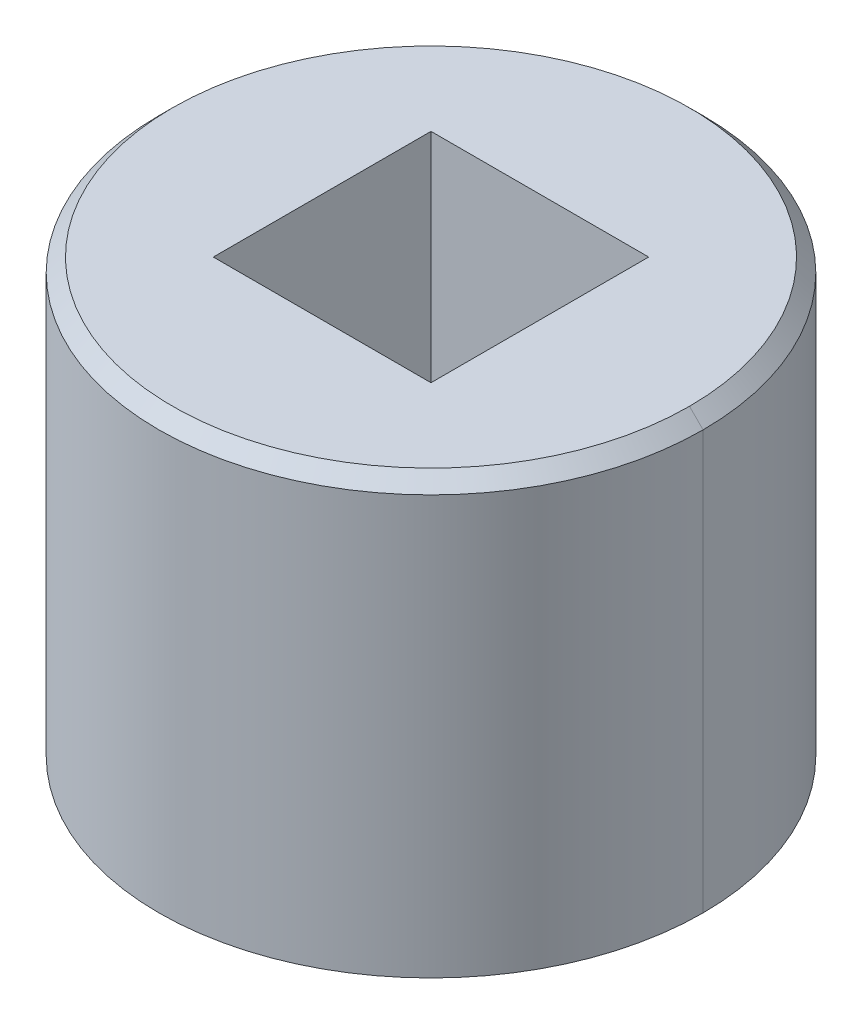
ISO-10303-21;
HEADER;
FILE_DESCRIPTION(('STEP AP214'),'2;1');
FILE_NAME('part.step','',(''),(''),'','','');
FILE_SCHEMA(('AUTOMOTIVE_DESIGN { 1 0 10303 214 1 1 1 1 }'));
ENDSEC;
DATA;
#1=APPLICATION_CONTEXT('core data for automotive mechanical design processes');
#2=APPLICATION_PROTOCOL_DEFINITION('international standard','automotive_design',2000,#1);
#3=PRODUCT_CONTEXT('',#1,'mechanical');
#4=PRODUCT('Part','Part','',(#3));
#5=PRODUCT_RELATED_PRODUCT_CATEGORY('part','',(#4));
#6=PRODUCT_DEFINITION_FORMATION('','',#4);
#7=PRODUCT_DEFINITION_CONTEXT('part definition',#1,'design');
#8=PRODUCT_DEFINITION('design','',#6,#7);
#9=PRODUCT_DEFINITION_SHAPE('','',#8);
#10=(LENGTH_UNIT() NAMED_UNIT(*) SI_UNIT(.MILLI.,.METRE.));
#11=(NAMED_UNIT(*) PLANE_ANGLE_UNIT() SI_UNIT($,.RADIAN.));
#12=(NAMED_UNIT(*) SI_UNIT($,.STERADIAN.) SOLID_ANGLE_UNIT());
#13=UNCERTAINTY_MEASURE_WITH_UNIT(LENGTH_MEASURE(1.E-05),#10,'distance_accuracy_value','');
#14=(GEOMETRIC_REPRESENTATION_CONTEXT(3) GLOBAL_UNCERTAINTY_ASSIGNED_CONTEXT((#13)) GLOBAL_UNIT_ASSIGNED_CONTEXT((#10,
#11,#12)) REPRESENTATION_CONTEXT('',''));
#15=CARTESIAN_POINT('',(0.,0.,0.));
#16=DIRECTION('',(0.,0.,1.));
#17=DIRECTION('',(1.,0.,0.));
#18=AXIS2_PLACEMENT_3D('',#15,#16,#17);
#19=CARTESIAN_POINT('',(0.,-3.175,0.));
#20=DIRECTION('',(0.,1.,0.));
#21=DIRECTION('',(1.,0.,0.));
#22=AXIS2_PLACEMENT_3D('',#19,#20,#21);
#23=PLANE('',#22);
#24=CARTESIAN_POINT('',(0.,-3.175,0.));
#25=DIRECTION('',(0.,-1.,0.));
#26=DIRECTION('',(0.,0.,-1.));
#27=AXIS2_PLACEMENT_3D('',#24,#25,#26);
#28=CIRCLE('',#27,4.);
#29=CARTESIAN_POINT('',(4.,-3.175,0.));
#30=VERTEX_POINT('',#29);
#31=CARTESIAN_POINT('',(-4.,-3.175,0.));
#32=VERTEX_POINT('',#31);
#33=EDGE_CURVE('E354',#30,#32,#28,.T.);
#34=ORIENTED_EDGE('',*,*,#33,.T.);
#35=CARTESIAN_POINT('',(0.,-3.175,0.));
#36=DIRECTION('',(0.,-1.,0.));
#37=DIRECTION('',(0.,0.,-1.));
#38=AXIS2_PLACEMENT_3D('',#35,#36,#37);
#39=CIRCLE('',#38,4.);
#40=EDGE_CURVE('E387',#32,#30,#39,.T.);
#41=ORIENTED_EDGE('',*,*,#40,.T.);
#42=EDGE_LOOP('',(#34,#41));
#43=FACE_BOUND('',#42,.T.);
#44=ADVANCED_FACE('F17',(#43),#23,.F.);
#45=CARTESIAN_POINT('',(1.6,0.,-1.6));
#46=DIRECTION('',(0.,0.,-1.));
#47=DIRECTION('',(0.,-1.,0.));
#48=AXIS2_PLACEMENT_3D('',#45,#46,#47);
#49=PLANE('',#48);
#50=DIRECTION('',(1.,0.,0.));
#51=VECTOR('',#50,1.);
#52=CARTESIAN_POINT('',(0.8,-2.825,-1.6));
#53=LINE('',#52,#51);
#54=CARTESIAN_POINT('',(-1.6,-2.825,-1.6));
#55=VERTEX_POINT('',#54);
#56=CARTESIAN_POINT('',(1.6,-2.825,-1.6));
#57=VERTEX_POINT('',#56);
#58=EDGE_CURVE('E59',#55,#57,#53,.T.);
#59=ORIENTED_EDGE('',*,*,#58,.T.);
#60=DIRECTION('',(0.,-1.,0.));
#61=VECTOR('',#60,1.);
#62=CARTESIAN_POINT('',(1.6,0.,-1.6));
#63=LINE('',#62,#61);
#64=CARTESIAN_POINT('',(1.6,3.175,-1.6));
#65=VERTEX_POINT('',#64);
#66=EDGE_CURVE('E39',#65,#57,#63,.T.);
#67=ORIENTED_EDGE('',*,*,#66,.F.);
#68=DIRECTION('',(1.,0.,0.));
#69=VECTOR('',#68,1.);
#70=CARTESIAN_POINT('',(0.8,3.175,-1.6));
#71=LINE('',#70,#69);
#72=CARTESIAN_POINT('',(-1.6,3.175,-1.6));
#73=VERTEX_POINT('',#72);
#74=EDGE_CURVE('E62',#73,#65,#71,.T.);
#75=ORIENTED_EDGE('',*,*,#74,.F.);
#76=DIRECTION('',(0.,-1.,0.));
#77=VECTOR('',#76,1.);
#78=CARTESIAN_POINT('',(-1.6,0.,-1.6));
#79=LINE('',#78,#77);
#80=EDGE_CURVE('E11',#73,#55,#79,.T.);
#81=ORIENTED_EDGE('',*,*,#80,.T.);
#82=EDGE_LOOP('',(#59,#67,#75,#81));
#83=FACE_BOUND('',#82,.T.);
#84=ADVANCED_FACE('F58',(#83),#49,.F.);
#85=CARTESIAN_POINT('',(-1.6,0.,-1.6));
#86=DIRECTION('',(-1.,0.,0.));
#87=DIRECTION('',(0.,0.,1.));
#88=AXIS2_PLACEMENT_3D('',#85,#86,#87);
#89=PLANE('',#88);
#90=DIRECTION('',(0.,0.,-1.));
#91=VECTOR('',#90,1.);
#92=CARTESIAN_POINT('',(-1.6,-2.825,-0.8));
#93=LINE('',#92,#91);
#94=CARTESIAN_POINT('',(-1.6,-2.825,1.6));
#95=VERTEX_POINT('',#94);
#96=EDGE_CURVE('E71',#95,#55,#93,.T.);
#97=ORIENTED_EDGE('',*,*,#96,.T.);
#98=ORIENTED_EDGE('',*,*,#80,.F.);
#99=DIRECTION('',(0.,0.,-1.));
#100=VECTOR('',#99,1.);
#101=CARTESIAN_POINT('',(-1.6,3.175,-0.8));
#102=LINE('',#101,#100);
#103=CARTESIAN_POINT('',(-1.6,3.175,1.6));
#104=VERTEX_POINT('',#103);
#105=EDGE_CURVE('E351',#104,#73,#102,.T.);
#106=ORIENTED_EDGE('',*,*,#105,.F.);
#107=DIRECTION('',(0.,-1.,0.));
#108=VECTOR('',#107,1.);
#109=CARTESIAN_POINT('',(-1.6,0.,1.6));
#110=LINE('',#109,#108);
#111=EDGE_CURVE('E26',#104,#95,#110,.T.);
#112=ORIENTED_EDGE('',*,*,#111,.T.);
#113=EDGE_LOOP('',(#97,#98,#106,#112));
#114=FACE_BOUND('',#113,.T.);
#115=ADVANCED_FACE('F76',(#114),#89,.F.);
#116=CARTESIAN_POINT('',(-1.6,0.,1.6));
#117=DIRECTION('',(0.,0.,1.));
#118=DIRECTION('',(1.,0.,0.));
#119=AXIS2_PLACEMENT_3D('',#116,#117,#118);
#120=PLANE('',#119);
#121=DIRECTION('',(-1.,0.,0.));
#122=VECTOR('',#121,1.);
#123=CARTESIAN_POINT('',(-0.8,-2.825,1.6));
#124=LINE('',#123,#122);
#125=CARTESIAN_POINT('',(1.6,-2.825,1.6));
#126=VERTEX_POINT('',#125);
#127=EDGE_CURVE('E80',#126,#95,#124,.T.);
#128=ORIENTED_EDGE('',*,*,#127,.T.);
#129=ORIENTED_EDGE('',*,*,#111,.F.);
#130=DIRECTION('',(-1.,0.,0.));
#131=VECTOR('',#130,1.);
#132=CARTESIAN_POINT('',(-0.8,3.175,1.6));
#133=LINE('',#132,#131);
#134=CARTESIAN_POINT('',(1.6,3.175,1.6));
#135=VERTEX_POINT('',#134);
#136=EDGE_CURVE('E81',#135,#104,#133,.T.);
#137=ORIENTED_EDGE('',*,*,#136,.F.);
#138=DIRECTION('',(0.,1.,0.));
#139=VECTOR('',#138,1.);
#140=CARTESIAN_POINT('',(1.6,0.,1.6));
#141=LINE('',#140,#139);
#142=EDGE_CURVE('E74',#126,#135,#141,.T.);
#143=ORIENTED_EDGE('',*,*,#142,.F.);
#144=EDGE_LOOP('',(#128,#129,#137,#143));
#145=FACE_BOUND('',#144,.T.);
#146=ADVANCED_FACE('F148',(#145),#120,.F.);
#147=CARTESIAN_POINT('',(1.6,0.,1.6));
#148=DIRECTION('',(1.,0.,0.));
#149=DIRECTION('',(0.,1.,0.));
#150=AXIS2_PLACEMENT_3D('',#147,#148,#149);
#151=PLANE('',#150);
#152=DIRECTION('',(0.,0.,1.));
#153=VECTOR('',#152,1.);
#154=CARTESIAN_POINT('',(1.6,-2.825,0.8));
#155=LINE('',#154,#153);
#156=EDGE_CURVE('E72',#57,#126,#155,.T.);
#157=ORIENTED_EDGE('',*,*,#156,.T.);
#158=ORIENTED_EDGE('',*,*,#142,.T.);
#159=DIRECTION('',(0.,0.,1.));
#160=VECTOR('',#159,1.);
#161=CARTESIAN_POINT('',(1.6,3.175,0.8));
#162=LINE('',#161,#160);
#163=EDGE_CURVE('E90',#65,#135,#162,.T.);
#164=ORIENTED_EDGE('',*,*,#163,.F.);
#165=ORIENTED_EDGE('',*,*,#66,.T.);
#166=EDGE_LOOP('',(#157,#158,#164,#165));
#167=FACE_BOUND('',#166,.T.);
#168=ADVANCED_FACE('F144',(#167),#151,.F.);
#169=CARTESIAN_POINT('',(0.,-2.825,0.));
#170=DIRECTION('',(0.,1.,0.));
#171=DIRECTION('',(1.,0.,0.));
#172=AXIS2_PLACEMENT_3D('',#169,#170,#171);
#173=PLANE('',#172);
#174=ORIENTED_EDGE('',*,*,#96,.F.);
#175=ORIENTED_EDGE('',*,*,#127,.F.);
#176=ORIENTED_EDGE('',*,*,#156,.F.);
#177=ORIENTED_EDGE('',*,*,#58,.F.);
#178=EDGE_LOOP('',(#174,#175,#176,#177));
#179=FACE_BOUND('',#178,.T.);
#180=ADVANCED_FACE('F69',(#179),#173,.T.);
#181=CARTESIAN_POINT('',(0.,3.175,0.));
#182=DIRECTION('',(0.,1.,0.));
#183=DIRECTION('',(1.,0.,0.));
#184=AXIS2_PLACEMENT_3D('',#181,#182,#183);
#185=PLANE('',#184);
#186=ORIENTED_EDGE('',*,*,#105,.T.);
#187=ORIENTED_EDGE('',*,*,#74,.T.);
#188=ORIENTED_EDGE('',*,*,#163,.T.);
#189=ORIENTED_EDGE('',*,*,#136,.T.);
#190=EDGE_LOOP('',(#186,#187,#188,#189));
#191=FACE_BOUND('',#190,.T.);
#192=CARTESIAN_POINT('',(0.,3.175,0.));
#193=DIRECTION('',(0.,-1.,0.));
#194=DIRECTION('',(0.,0.,-1.));
#195=AXIS2_PLACEMENT_3D('',#192,#193,#194);
#196=CIRCLE('',#195,3.8);
#197=CARTESIAN_POINT('',(3.8,3.175,0.));
#198=VERTEX_POINT('',#197);
#199=CARTESIAN_POINT('',(-3.8,3.175,0.));
#200=VERTEX_POINT('',#199);
#201=EDGE_CURVE('E367',#198,#200,#196,.T.);
#202=ORIENTED_EDGE('',*,*,#201,.F.);
#203=CARTESIAN_POINT('',(0.,3.175,0.));
#204=DIRECTION('',(0.,-1.,0.));
#205=DIRECTION('',(0.,0.,-1.));
#206=AXIS2_PLACEMENT_3D('',#203,#204,#205);
#207=CIRCLE('',#206,3.8);
#208=EDGE_CURVE('E357',#200,#198,#207,.T.);
#209=ORIENTED_EDGE('',*,*,#208,.F.);
#210=EDGE_LOOP('',(#202,#209));
#211=FACE_BOUND('',#210,.T.);
#212=ADVANCED_FACE('F128',(#191,#211),#185,.T.);
#213=CARTESIAN_POINT('',(0.,0.,0.));
#214=DIRECTION('',(0.,1.,0.));
#215=DIRECTION('',(1.,0.,0.));
#216=AXIS2_PLACEMENT_3D('',#213,#214,#215);
#217=CYLINDRICAL_SURFACE('',#216,4.);
#218=DIRECTION('',(0.,1.,0.));
#219=VECTOR('',#218,1.);
#220=CARTESIAN_POINT('',(-4.,0.,0.));
#221=LINE('',#220,#219);
#222=CARTESIAN_POINT('',(-4.,2.975,0.));
#223=VERTEX_POINT('',#222);
#224=EDGE_CURVE('E383',#32,#223,#221,.T.);
#225=ORIENTED_EDGE('',*,*,#224,.F.);
#226=ORIENTED_EDGE('',*,*,#33,.F.);
#227=DIRECTION('',(0.,1.,0.));
#228=VECTOR('',#227,1.);
#229=CARTESIAN_POINT('',(4.,0.,0.));
#230=LINE('',#229,#228);
#231=CARTESIAN_POINT('',(4.,2.975,0.));
#232=VERTEX_POINT('',#231);
#233=EDGE_CURVE('E371',#30,#232,#230,.T.);
#234=ORIENTED_EDGE('',*,*,#233,.T.);
#235=CARTESIAN_POINT('',(0.,2.975,0.));
#236=DIRECTION('',(0.,1.,0.));
#237=DIRECTION('',(1.,0.,0.));
#238=AXIS2_PLACEMENT_3D('',#235,#236,#237);
#239=CIRCLE('',#238,4.);
#240=EDGE_CURVE('E358',#223,#232,#239,.T.);
#241=ORIENTED_EDGE('',*,*,#240,.F.);
#242=EDGE_LOOP('',(#225,#226,#234,#241));
#243=FACE_BOUND('',#242,.T.);
#244=ADVANCED_FACE('F123',(#243),#217,.T.);
#245=CARTESIAN_POINT('',(0.,3.075,0.));
#246=DIRECTION('',(0.,-1.,0.));
#247=DIRECTION('',(1.,0.,0.));
#248=AXIS2_PLACEMENT_3D('',#245,#246,#247);
#249=CONICAL_SURFACE('',#248,3.9,0.785398163397448);
#250=DIRECTION('',(-0.707106781186548,-0.707106781186548,0.));
#251=VECTOR('',#250,1.);
#252=CARTESIAN_POINT('',(-3.9,3.075,0.));
#253=LINE('',#252,#251);
#254=EDGE_CURVE('E363',#200,#223,#253,.T.);
#255=ORIENTED_EDGE('',*,*,#254,.F.);
#256=ORIENTED_EDGE('',*,*,#208,.T.);
#257=DIRECTION('',(0.707106781186548,-0.707106781186548,0.));
#258=VECTOR('',#257,1.);
#259=CARTESIAN_POINT('',(3.9,3.075,0.));
#260=LINE('',#259,#258);
#261=EDGE_CURVE('E362',#198,#232,#260,.T.);
#262=ORIENTED_EDGE('',*,*,#261,.T.);
#263=CARTESIAN_POINT('',(0.,2.975,0.));
#264=DIRECTION('',(0.,1.,0.));
#265=DIRECTION('',(1.,0.,0.));
#266=AXIS2_PLACEMENT_3D('',#263,#264,#265);
#267=CIRCLE('',#266,4.);
#268=EDGE_CURVE('E375',#232,#223,#267,.T.);
#269=ORIENTED_EDGE('',*,*,#268,.T.);
#270=EDGE_LOOP('',(#255,#256,#262,#269));
#271=FACE_BOUND('',#270,.T.);
#272=ADVANCED_FACE('F127',(#271),#249,.T.);
#273=CARTESIAN_POINT('',(0.,3.075,0.));
#274=DIRECTION('',(0.,-1.,0.));
#275=DIRECTION('',(1.,0.,0.));
#276=AXIS2_PLACEMENT_3D('',#273,#274,#275);
#277=CONICAL_SURFACE('',#276,3.9,0.785398163397448);
#278=ORIENTED_EDGE('',*,*,#201,.T.);
#279=ORIENTED_EDGE('',*,*,#254,.T.);
#280=ORIENTED_EDGE('',*,*,#240,.T.);
#281=ORIENTED_EDGE('',*,*,#261,.F.);
#282=EDGE_LOOP('',(#278,#279,#280,#281));
#283=FACE_BOUND('',#282,.T.);
#284=ADVANCED_FACE('F115',(#283),#277,.T.);
#285=CARTESIAN_POINT('',(0.,0.,0.));
#286=DIRECTION('',(0.,1.,0.));
#287=DIRECTION('',(1.,0.,0.));
#288=AXIS2_PLACEMENT_3D('',#285,#286,#287);
#289=CYLINDRICAL_SURFACE('',#288,4.);
#290=ORIENTED_EDGE('',*,*,#40,.F.);
#291=ORIENTED_EDGE('',*,*,#224,.T.);
#292=ORIENTED_EDGE('',*,*,#268,.F.);
#293=ORIENTED_EDGE('',*,*,#233,.F.);
#294=EDGE_LOOP('',(#290,#291,#292,#293));
#295=FACE_BOUND('',#294,.T.);
#296=ADVANCED_FACE('F110',(#295),#289,.T.);
#297=CLOSED_SHELL('',(#44,#84,#115,#146,#168,#180,#212,#244,#272,#284,#296));
#298=MANIFOLD_SOLID_BREP('B1',#297);
#299=ADVANCED_BREP_SHAPE_REPRESENTATION('',(#18,#298),#14);
#300=SHAPE_DEFINITION_REPRESENTATION(#9,#299);
ENDSEC;
END-ISO-10303-21;
